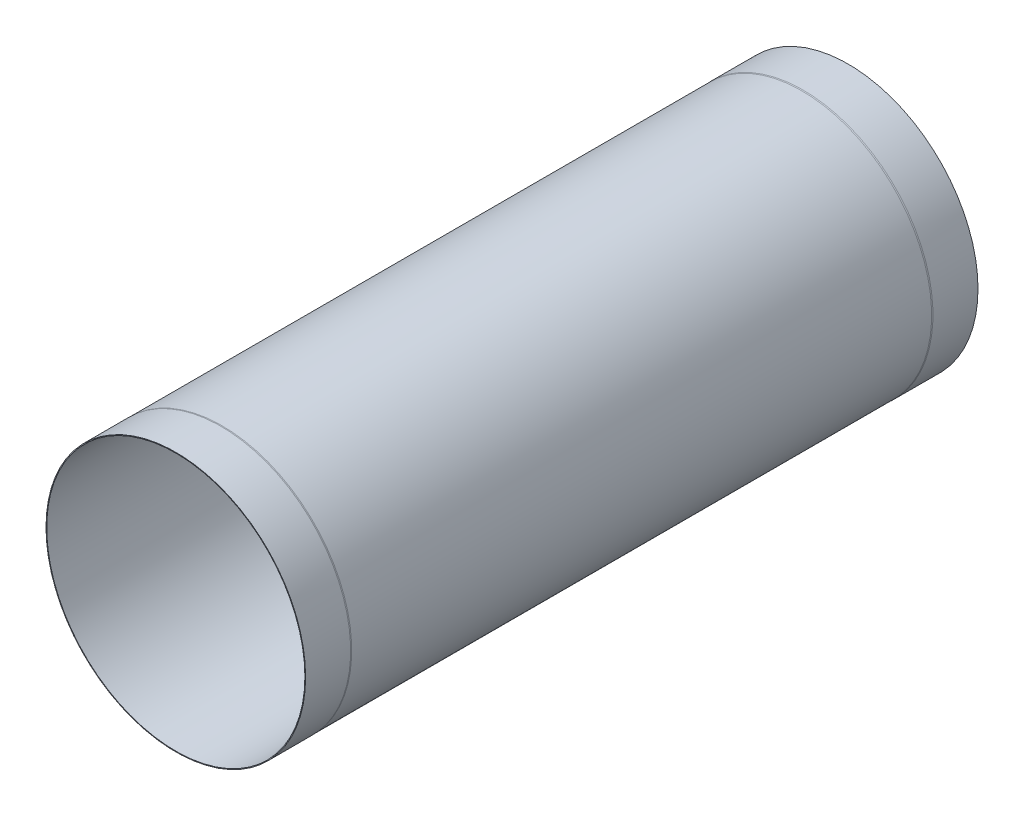
ISO-10303-21;
HEADER;
FILE_DESCRIPTION(('STEP AP214'),'2;1');
FILE_NAME('part.step','',(''),(''),'','','');
FILE_SCHEMA(('AUTOMOTIVE_DESIGN { 1 0 10303 214 1 1 1 1 }'));
ENDSEC;
DATA;
#1=APPLICATION_CONTEXT('core data for automotive mechanical design processes');
#2=APPLICATION_PROTOCOL_DEFINITION('international standard','automotive_design',2000,#1);
#3=PRODUCT_CONTEXT('',#1,'mechanical');
#4=PRODUCT('Part','Part','',(#3));
#5=PRODUCT_RELATED_PRODUCT_CATEGORY('part','',(#4));
#6=PRODUCT_DEFINITION_FORMATION('','',#4);
#7=PRODUCT_DEFINITION_CONTEXT('part definition',#1,'design');
#8=PRODUCT_DEFINITION('design','',#6,#7);
#9=PRODUCT_DEFINITION_SHAPE('','',#8);
#10=(LENGTH_UNIT() NAMED_UNIT(*) SI_UNIT(.MILLI.,.METRE.));
#11=(NAMED_UNIT(*) PLANE_ANGLE_UNIT() SI_UNIT($,.RADIAN.));
#12=(NAMED_UNIT(*) SI_UNIT($,.STERADIAN.) SOLID_ANGLE_UNIT());
#13=UNCERTAINTY_MEASURE_WITH_UNIT(LENGTH_MEASURE(1.E-05),#10,'distance_accuracy_value','');
#14=(GEOMETRIC_REPRESENTATION_CONTEXT(3) GLOBAL_UNCERTAINTY_ASSIGNED_CONTEXT((#13)) GLOBAL_UNIT_ASSIGNED_CONTEXT((#10,
#11,#12)) REPRESENTATION_CONTEXT('',''));
#15=CARTESIAN_POINT('',(0.,0.,0.));
#16=DIRECTION('',(0.,0.,1.));
#17=DIRECTION('',(1.,0.,0.));
#18=AXIS2_PLACEMENT_3D('',#15,#16,#17);
#19=CARTESIAN_POINT('',(0.,0.,559.8));
#20=DIRECTION('',(0.,0.,-1.));
#21=DIRECTION('',(-1.,0.,0.));
#22=AXIS2_PLACEMENT_3D('',#19,#20,#21);
#23=CYLINDRICAL_SURFACE('',#22,216.126);
#24=CARTESIAN_POINT('',(0.,0.,-559.8));
#25=DIRECTION('',(0.,0.,1.));
#26=DIRECTION('',(1.,0.,0.));
#27=AXIS2_PLACEMENT_3D('',#24,#25,#26);
#28=CIRCLE('',#27,216.126);
#29=CARTESIAN_POINT('',(216.126,0.,-559.8));
#30=VERTEX_POINT('',#29);
#31=EDGE_CURVE('E38',#30,#30,#28,.T.);
#32=ORIENTED_EDGE('',*,*,#31,.T.);
#33=EDGE_LOOP('',(#32));
#34=FACE_BOUND('',#33,.T.);
#35=CARTESIAN_POINT('',(0.,0.,-484.8));
#36=DIRECTION('',(0.,0.,-1.));
#37=DIRECTION('',(-1.,0.,0.));
#38=AXIS2_PLACEMENT_3D('',#35,#36,#37);
#39=CIRCLE('',#38,216.126);
#40=CARTESIAN_POINT('',(-216.126,0.,-484.8));
#41=VERTEX_POINT('',#40);
#42=EDGE_CURVE('E50',#41,#41,#39,.T.);
#43=ORIENTED_EDGE('',*,*,#42,.T.);
#44=EDGE_LOOP('',(#43));
#45=FACE_BOUND('',#44,.T.);
#46=ADVANCED_FACE('F35',(#34,#45),#23,.T.);
#47=CARTESIAN_POINT('',(0.,0.,559.8));
#48=DIRECTION('',(0.,0.,1.));
#49=DIRECTION('',(1.,0.,0.));
#50=AXIS2_PLACEMENT_3D('',#47,#48,#49);
#51=CIRCLE('',#50,216.126);
#52=CARTESIAN_POINT('',(216.126,0.,559.8));
#53=VERTEX_POINT('',#52);
#54=EDGE_CURVE('E10',#53,#53,#51,.T.);
#55=ORIENTED_EDGE('',*,*,#54,.F.);
#56=EDGE_LOOP('',(#55));
#57=FACE_BOUND('',#56,.T.);
#58=CARTESIAN_POINT('',(0.,0.,484.8));
#59=DIRECTION('',(0.,0.,-1.));
#60=DIRECTION('',(-1.,0.,0.));
#61=AXIS2_PLACEMENT_3D('',#58,#59,#60);
#62=CIRCLE('',#61,216.126);
#63=CARTESIAN_POINT('',(-216.126,0.,484.8));
#64=VERTEX_POINT('',#63);
#65=EDGE_CURVE('E61',#64,#64,#62,.T.);
#66=ORIENTED_EDGE('',*,*,#65,.F.);
#67=EDGE_LOOP('',(#66));
#68=FACE_BOUND('',#67,.T.);
#69=ADVANCED_FACE('F68',(#57,#68),#23,.T.);
#70=CARTESIAN_POINT('',(0.,0.,559.8));
#71=DIRECTION('',(0.,0.,1.));
#72=DIRECTION('',(1.,0.,0.));
#73=AXIS2_PLACEMENT_3D('',#70,#71,#72);
#74=PLANE('',#73);
#75=ORIENTED_EDGE('',*,*,#54,.T.);
#76=EDGE_LOOP('',(#75));
#77=FACE_BOUND('',#76,.T.);
#78=CARTESIAN_POINT('',(0.,0.,559.8));
#79=DIRECTION('',(0.,0.,1.));
#80=DIRECTION('',(1.,0.,0.));
#81=AXIS2_PLACEMENT_3D('',#78,#79,#80);
#82=CIRCLE('',#81,214.95);
#83=CARTESIAN_POINT('',(214.95,0.,559.8));
#84=VERTEX_POINT('',#83);
#85=EDGE_CURVE('E45',#84,#84,#82,.T.);
#86=ORIENTED_EDGE('',*,*,#85,.F.);
#87=EDGE_LOOP('',(#86));
#88=FACE_BOUND('',#87,.T.);
#89=ADVANCED_FACE('F70',(#77,#88),#74,.T.);
#90=CARTESIAN_POINT('',(0.,0.,-559.8));
#91=DIRECTION('',(0.,0.,1.));
#92=DIRECTION('',(1.,0.,0.));
#93=AXIS2_PLACEMENT_3D('',#90,#91,#92);
#94=PLANE('',#93);
#95=ORIENTED_EDGE('',*,*,#31,.F.);
#96=EDGE_LOOP('',(#95));
#97=FACE_BOUND('',#96,.T.);
#98=CARTESIAN_POINT('',(0.,0.,-559.8));
#99=DIRECTION('',(0.,0.,1.));
#100=DIRECTION('',(1.,0.,0.));
#101=AXIS2_PLACEMENT_3D('',#98,#99,#100);
#102=CIRCLE('',#101,214.95);
#103=CARTESIAN_POINT('',(214.95,0.,-559.8));
#104=VERTEX_POINT('',#103);
#105=EDGE_CURVE('E47',#104,#104,#102,.T.);
#106=ORIENTED_EDGE('',*,*,#105,.T.);
#107=EDGE_LOOP('',(#106));
#108=FACE_BOUND('',#107,.T.);
#109=ADVANCED_FACE('F76',(#97,#108),#94,.F.);
#110=CARTESIAN_POINT('',(0.,0.,559.8));
#111=DIRECTION('',(0.,0.,-1.));
#112=DIRECTION('',(-1.,0.,0.));
#113=AXIS2_PLACEMENT_3D('',#110,#111,#112);
#114=CYLINDRICAL_SURFACE('',#113,214.95);
#115=ORIENTED_EDGE('',*,*,#85,.T.);
#116=EDGE_LOOP('',(#115));
#117=FACE_BOUND('',#116,.T.);
#118=ORIENTED_EDGE('',*,*,#105,.F.);
#119=EDGE_LOOP('',(#118));
#120=FACE_BOUND('',#119,.T.);
#121=ADVANCED_FACE('F88',(#117,#120),#114,.F.);
#122=CARTESIAN_POINT('',(0.,0.,-484.8));
#123=DIRECTION('',(0.,0.,-1.));
#124=DIRECTION('',(-1.,0.,0.));
#125=AXIS2_PLACEMENT_3D('',#122,#123,#124);
#126=CONICAL_SURFACE('',#125,216.126,0.110053522218587);
#127=CARTESIAN_POINT('',(0.,0.,-482.8));
#128=DIRECTION('',(0.,0.,-1.));
#129=DIRECTION('',(-1.,0.,0.));
#130=AXIS2_PLACEMENT_3D('',#127,#128,#129);
#131=CIRCLE('',#130,215.905);
#132=CARTESIAN_POINT('',(-215.905,0.,-482.8));
#133=VERTEX_POINT('',#132);
#134=EDGE_CURVE('E55',#133,#133,#131,.T.);
#135=ORIENTED_EDGE('',*,*,#134,.T.);
#136=EDGE_LOOP('',(#135));
#137=FACE_BOUND('',#136,.T.);
#138=ORIENTED_EDGE('',*,*,#42,.F.);
#139=EDGE_LOOP('',(#138));
#140=FACE_BOUND('',#139,.T.);
#141=ADVANCED_FACE('F85',(#137,#140),#126,.T.);
#142=CARTESIAN_POINT('',(0.,0.,-624.558028956702));
#143=DIRECTION('',(0.,0.,-1.));
#144=DIRECTION('',(-1.,0.,0.));
#145=AXIS2_PLACEMENT_3D('',#142,#143,#144);
#146=CYLINDRICAL_SURFACE('',#145,215.905);
#147=CARTESIAN_POINT('',(0.,0.,482.8));
#148=DIRECTION('',(0.,0.,-1.));
#149=DIRECTION('',(-1.,0.,0.));
#150=AXIS2_PLACEMENT_3D('',#147,#148,#149);
#151=CIRCLE('',#150,215.905);
#152=CARTESIAN_POINT('',(-215.905,0.,482.8));
#153=VERTEX_POINT('',#152);
#154=EDGE_CURVE('E58',#153,#153,#151,.T.);
#155=ORIENTED_EDGE('',*,*,#154,.T.);
#156=EDGE_LOOP('',(#155));
#157=FACE_BOUND('',#156,.T.);
#158=ORIENTED_EDGE('',*,*,#134,.F.);
#159=EDGE_LOOP('',(#158));
#160=FACE_BOUND('',#159,.T.);
#161=ADVANCED_FACE('F87',(#157,#160),#146,.T.);
#162=CARTESIAN_POINT('',(0.,0.,482.8));
#163=DIRECTION('',(0.,0.,1.));
#164=DIRECTION('',(1.,0.,0.));
#165=AXIS2_PLACEMENT_3D('',#162,#163,#164);
#166=CONICAL_SURFACE('',#165,215.905,0.110053522218575);
#167=ORIENTED_EDGE('',*,*,#65,.T.);
#168=EDGE_LOOP('',(#167));
#169=FACE_BOUND('',#168,.T.);
#170=ORIENTED_EDGE('',*,*,#154,.F.);
#171=EDGE_LOOP('',(#170));
#172=FACE_BOUND('',#171,.T.);
#173=ADVANCED_FACE('F65',(#169,#172),#166,.T.);
#174=CLOSED_SHELL('',(#46,#69,#89,#109,#121,#141,#161,#173));
#175=MANIFOLD_SOLID_BREP('B2',#174);
#176=ADVANCED_BREP_SHAPE_REPRESENTATION('',(#18,#175),#14);
#177=SHAPE_DEFINITION_REPRESENTATION(#9,#176);
ENDSEC;
END-ISO-10303-21;
